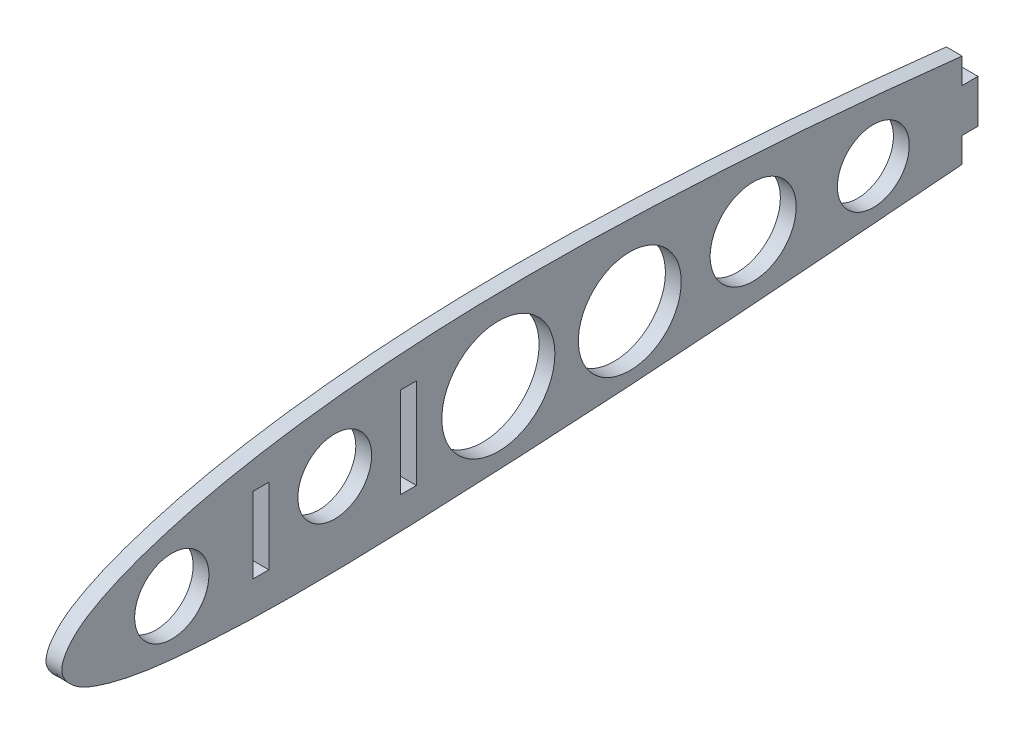
ISO-10303-21;
HEADER;
FILE_DESCRIPTION(('STEP AP214'),'2;1');
FILE_NAME('part.step','',(''),(''),'','','');
FILE_SCHEMA(('AUTOMOTIVE_DESIGN { 1 0 10303 214 1 1 1 1 }'));
ENDSEC;
DATA;
#1=APPLICATION_CONTEXT('core data for automotive mechanical design processes');
#2=APPLICATION_PROTOCOL_DEFINITION('international standard','automotive_design',2000,#1);
#3=PRODUCT_CONTEXT('',#1,'mechanical');
#4=PRODUCT('Part','Part','',(#3));
#5=PRODUCT_RELATED_PRODUCT_CATEGORY('part','',(#4));
#6=PRODUCT_DEFINITION_FORMATION('','',#4);
#7=PRODUCT_DEFINITION_CONTEXT('part definition',#1,'design');
#8=PRODUCT_DEFINITION('design','',#6,#7);
#9=PRODUCT_DEFINITION_SHAPE('','',#8);
#10=(LENGTH_UNIT() NAMED_UNIT(*) SI_UNIT(.MILLI.,.METRE.));
#11=(NAMED_UNIT(*) PLANE_ANGLE_UNIT() SI_UNIT($,.RADIAN.));
#12=(NAMED_UNIT(*) SI_UNIT($,.STERADIAN.) SOLID_ANGLE_UNIT());
#13=UNCERTAINTY_MEASURE_WITH_UNIT(LENGTH_MEASURE(1.E-05),#10,'distance_accuracy_value','');
#14=(GEOMETRIC_REPRESENTATION_CONTEXT(3) GLOBAL_UNCERTAINTY_ASSIGNED_CONTEXT((#13)) GLOBAL_UNIT_ASSIGNED_CONTEXT((#10,
#11,#12)) REPRESENTATION_CONTEXT('',''));
#15=CARTESIAN_POINT('',(0.,0.,0.));
#16=DIRECTION('',(0.,0.,1.));
#17=DIRECTION('',(1.,0.,0.));
#18=AXIS2_PLACEMENT_3D('',#15,#16,#17);
#19=CARTESIAN_POINT('',(3.,35.6725083787805,-268.796840466726));
#20=CARTESIAN_POINT('',(3.,36.4274536176114,-264.720288829096));
#21=CARTESIAN_POINT('',(3.,37.9353612910288,-256.577892295824));
#22=CARTESIAN_POINT('',(3.,40.6710911965768,-240.284487090343));
#23=CARTESIAN_POINT('',(3.,43.6582699218128,-219.915007865058));
#24=CARTESIAN_POINT('',(3.,46.6859521400267,-195.466083589585));
#25=CARTESIAN_POINT('',(3.,49.1340817664586,-171.032194679108));
#26=CARTESIAN_POINT('',(3.,50.8023986505565,-146.60254973474));
#27=CARTESIAN_POINT('',(3.,51.7826936533196,-122.191533804464));
#28=CARTESIAN_POINT('',(3.,51.6405055291905,-101.842925906633));
#29=CARTESIAN_POINT('',(3.,50.6584632078832,-85.5965779619287));
#30=CARTESIAN_POINT('',(3.,49.4402735662458,-73.4109942150779));
#31=CARTESIAN_POINT('',(3.,47.6462202215127,-61.2209387887358));
#32=CARTESIAN_POINT('',(3.,45.5296629802409,-51.0876277171563));
#33=CARTESIAN_POINT('',(3.,43.1996534506725,-43.0213639172619));
#34=CARTESIAN_POINT('',(3.,41.1045925047332,-36.9122400554517));
#35=CARTESIAN_POINT('',(3.,38.7006598345027,-31.7482460051726));
#36=CARTESIAN_POINT('',(3.,35.8207701765586,-27.3091511377608));
#37=CARTESIAN_POINT('',(3.,30.9135853099767,-23.4836316371993));
#38=CARTESIAN_POINT('',(3.,26.7429969145867,-27.6334209430324));
#39=CARTESIAN_POINT('',(3.,24.8893233487077,-32.0784001117748));
#40=CARTESIAN_POINT('',(3.,23.516154351296,-37.2912412060836));
#41=CARTESIAN_POINT('',(3.,22.5773588690756,-43.4377659033026));
#42=CARTESIAN_POINT('',(3.,21.8315270372831,-51.5949322119324));
#43=CARTESIAN_POINT('',(3.,21.3314858655082,-61.7688680642342));
#44=CARTESIAN_POINT('',(3.,21.2854162932154,-73.9746097226715));
#45=CARTESIAN_POINT('',(3.,21.5557900033601,-86.1656281806752));
#46=CARTESIAN_POINT('',(3.,22.2233845979576,-102.412296423289));
#47=CARTESIAN_POINT('',(3.,23.2550373184634,-122.718782884065));
#48=CARTESIAN_POINT('',(3.,24.8417754069201,-147.07692435792));
#49=CARTESIAN_POINT('',(3.,26.7651546502408,-171.421597620585));
#50=CARTESIAN_POINT('',(3.,28.7461770154961,-195.769310914877));
#51=CARTESIAN_POINT('',(3.,30.7458206301182,-220.120839870705));
#52=CARTESIAN_POINT('',(3.,32.5467474021077,-240.40453676189));
#53=CARTESIAN_POINT('',(3.,33.9469989708258,-256.637275317102));
#54=CARTESIAN_POINT('',(3.,34.6747704592301,-264.751495034581));
#55=CARTESIAN_POINT('',(3.,35.0386811925504,-268.808883507144));
#56=B_SPLINE_CURVE_WITH_KNOTS('',3,(#19,#20,#21,#22,#23,#24,#25,#26,#27,#28,#29,#30,#31,#32,#33,
#34,#35,#36,#37,#38,#39,#40,#41,#42,#43,#44,#45,#46,#47,#48,#49,#50,#51,#52,#53,#54,#55),
.UNSPECIFIED.,.F.,.F.,(4,1,1,1,1,1,1,1,1,1,1,1,1,1,1,1,1,1,1,1,1,1,1,1,1,1,1,1,1,1,1,1,1,1,4),
(0.,0.0250124897498648,0.0499592861642578,0.0996729249269686,0.149206319909966,
0.198581096615965,0.247805170456833,0.296916574601493,0.345952721793533,0.370491625569911,
0.395091203654929,0.41981479582396,0.444798575016595,0.457489818915221,0.47040640543549,
0.483879408669829,0.491264120322896,0.503458853294665,0.513609129403887,0.520450990700287,
0.533235387615153,0.545691039147803,0.558031884237173,0.582609167247894,0.607134741746914,
0.631652079836766,0.656174271859652,0.705233949250519,0.754320378530032,0.803437363555032,
0.852566095729537,0.901700994033254,0.95084880933727,0.975422716989278,1.),.UNSPECIFIED.);
#57=DIRECTION('',(-1.,0.,0.));
#58=VECTOR('',#57,1.);
#59=SURFACE_OF_LINEAR_EXTRUSION('',#56,#58);
#60=CARTESIAN_POINT('',(3.,46.54657380886,-195.85));
#61=VERTEX_POINT('',#60);
#62=CARTESIAN_POINT('',(3.,28.7558241716302,-195.85));
#63=VERTEX_POINT('',#62);
#64=EDGE_CURVE('E261',#61,#63,#56,.T.);
#65=ORIENTED_EDGE('',*,*,#64,.F.);
#66=DIRECTION('',(-1.,0.,0.));
#67=VECTOR('',#66,1.);
#68=CARTESIAN_POINT('',(3.,46.5465738066671,-195.85));
#69=LINE('',#68,#67);
#70=CARTESIAN_POINT('',(0.,46.54657380886,-195.85));
#71=VERTEX_POINT('',#70);
#72=EDGE_CURVE('E148',#61,#71,#69,.T.);
#73=ORIENTED_EDGE('',*,*,#72,.T.);
#74=CARTESIAN_POINT('',(0.,35.6725083787805,-268.796840466726));
#75=CARTESIAN_POINT('',(0.,36.4274536176114,-264.720288829096));
#76=CARTESIAN_POINT('',(0.,37.9353612910288,-256.577892295824));
#77=CARTESIAN_POINT('',(0.,40.6710911965768,-240.284487090343));
#78=CARTESIAN_POINT('',(0.,43.6582699218128,-219.915007865058));
#79=CARTESIAN_POINT('',(0.,46.6859521400267,-195.466083589585));
#80=CARTESIAN_POINT('',(0.,49.1340817664586,-171.032194679108));
#81=CARTESIAN_POINT('',(0.,50.8023986505565,-146.60254973474));
#82=CARTESIAN_POINT('',(0.,51.7826936533196,-122.191533804464));
#83=CARTESIAN_POINT('',(0.,51.6405055291905,-101.842925906633));
#84=CARTESIAN_POINT('',(0.,50.6584632078832,-85.5965779619287));
#85=CARTESIAN_POINT('',(0.,49.4402735662458,-73.4109942150779));
#86=CARTESIAN_POINT('',(0.,47.6462202215127,-61.2209387887358));
#87=CARTESIAN_POINT('',(0.,45.5296629802409,-51.0876277171563));
#88=CARTESIAN_POINT('',(0.,43.1996534506725,-43.0213639172619));
#89=CARTESIAN_POINT('',(0.,41.1045925047332,-36.9122400554517));
#90=CARTESIAN_POINT('',(0.,38.7006598345027,-31.7482460051726));
#91=CARTESIAN_POINT('',(0.,35.8207701765586,-27.3091511377608));
#92=CARTESIAN_POINT('',(0.,30.9135853099767,-23.4836316371993));
#93=CARTESIAN_POINT('',(0.,26.7429969145867,-27.6334209430324));
#94=CARTESIAN_POINT('',(0.,24.8893233487077,-32.0784001117748));
#95=CARTESIAN_POINT('',(0.,23.516154351296,-37.2912412060836));
#96=CARTESIAN_POINT('',(0.,22.5773588690756,-43.4377659033026));
#97=CARTESIAN_POINT('',(0.,21.8315270372831,-51.5949322119324));
#98=CARTESIAN_POINT('',(0.,21.3314858655082,-61.7688680642342));
#99=CARTESIAN_POINT('',(0.,21.2854162932154,-73.9746097226715));
#100=CARTESIAN_POINT('',(0.,21.5557900033601,-86.1656281806752));
#101=CARTESIAN_POINT('',(0.,22.2233845979576,-102.412296423289));
#102=CARTESIAN_POINT('',(0.,23.2550373184634,-122.718782884065));
#103=CARTESIAN_POINT('',(0.,24.8417754069201,-147.07692435792));
#104=CARTESIAN_POINT('',(0.,26.7651546502408,-171.421597620585));
#105=CARTESIAN_POINT('',(0.,28.7461770154961,-195.769310914877));
#106=CARTESIAN_POINT('',(0.,30.7458206301182,-220.120839870705));
#107=CARTESIAN_POINT('',(0.,32.5467474021077,-240.40453676189));
#108=CARTESIAN_POINT('',(0.,33.9469989708258,-256.637275317102));
#109=CARTESIAN_POINT('',(0.,34.6747704592301,-264.751495034581));
#110=CARTESIAN_POINT('',(0.,35.0386811925504,-268.808883507144));
#111=B_SPLINE_CURVE_WITH_KNOTS('',3,(#74,#75,#76,#77,#78,#79,#80,#81,#82,#83,#84,#85,#86,#87,
#88,#89,#90,#91,#92,#93,#94,#95,#96,#97,#98,#99,#100,#101,#102,#103,#104,#105,#106,#107,#108,
#109,#110),.UNSPECIFIED.,.F.,.F.,(4,1,1,1,1,1,1,1,1,1,1,1,1,1,1,1,1,1,1,1,1,1,1,1,1,1,1,1,1,1,1,
1,1,1,4),(0.,0.0250124897498648,0.0499592861642578,0.0996729249269686,0.149206319909966,
0.198581096615965,0.247805170456833,0.296916574601493,0.345952721793533,0.370491625569911,
0.395091203654929,0.41981479582396,0.444798575016595,0.457489818915221,0.47040640543549,
0.483879408669829,0.491264120322896,0.503458853294665,0.513609129403887,0.520450990700287,
0.533235387615153,0.545691039147803,0.558031884237173,0.582609167247894,0.607134741746914,
0.631652079836766,0.656174271859652,0.705233949250519,0.754320378530032,0.803437363555032,
0.852566095729537,0.901700994033254,0.95084880933727,0.975422716989278,1.),.UNSPECIFIED.);
#112=CARTESIAN_POINT('',(0.,28.7558241716302,-195.85));
#113=VERTEX_POINT('',#112);
#114=EDGE_CURVE('E260',#71,#113,#111,.T.);
#115=ORIENTED_EDGE('',*,*,#114,.T.);
#116=DIRECTION('',(-1.,0.,0.));
#117=VECTOR('',#116,1.);
#118=CARTESIAN_POINT('',(3.,28.7558241716302,-195.85));
#119=LINE('',#118,#117);
#120=EDGE_CURVE('E169',#113,#63,#119,.F.);
#121=ORIENTED_EDGE('',*,*,#120,.T.);
#122=EDGE_LOOP('',(#65,#73,#115,#121));
#123=FACE_BOUND('',#122,.T.);
#124=ADVANCED_FACE('F37',(#123),#59,.F.);
#125=CARTESIAN_POINT('',(3.,32.3296105524664,-25.2194378154386));
#126=DIRECTION('',(-1.,0.,0.));
#127=DIRECTION('',(0.,0.,1.));
#128=AXIS2_PLACEMENT_3D('',#125,#126,#127);
#129=PLANE('',#128);
#130=CARTESIAN_POINT('',(3.,32.7699956638871,-45.8730282964202));
#131=DIRECTION('',(1.,0.,0.));
#132=DIRECTION('',(0.,0.,-1.));
#133=AXIS2_PLACEMENT_3D('',#130,#131,#132);
#134=CIRCLE('',#133,7.04485787294361);
#135=CARTESIAN_POINT('',(3.,32.7699956638871,-52.9178861693638));
#136=VERTEX_POINT('',#135);
#137=EDGE_CURVE('E174',#136,#136,#134,.T.);
#138=ORIENTED_EDGE('',*,*,#137,.F.);
#139=EDGE_LOOP('',(#138));
#140=FACE_BOUND('',#139,.T.);
#141=CARTESIAN_POINT('',(3.,36.2890999852374,-107.839865259326));
#142=DIRECTION('',(1.,0.,0.));
#143=DIRECTION('',(0.,0.,-1.));
#144=AXIS2_PLACEMENT_3D('',#141,#142,#143);
#145=CIRCLE('',#144,10.7245156528873);
#146=CARTESIAN_POINT('',(3.,36.2890999852374,-118.564380912214));
#147=VERTEX_POINT('',#146);
#148=EDGE_CURVE('E178',#147,#147,#145,.T.);
#149=ORIENTED_EDGE('',*,*,#148,.F.);
#150=EDGE_LOOP('',(#149));
#151=FACE_BOUND('',#150,.T.);
#152=CARTESIAN_POINT('',(3.,36.1360954495265,-132.7796045802));
#153=DIRECTION('',(1.,0.,0.));
#154=DIRECTION('',(0.,0.,-1.));
#155=AXIS2_PLACEMENT_3D('',#152,#153,#154);
#156=CIRCLE('',#155,9.75876314769846);
#157=CARTESIAN_POINT('',(3.,36.1360954495265,-142.538367727898));
#158=VERTEX_POINT('',#157);
#159=EDGE_CURVE('E181',#158,#158,#156,.T.);
#160=ORIENTED_EDGE('',*,*,#159,.F.);
#161=EDGE_LOOP('',(#160));
#162=FACE_BOUND('',#161,.T.);
#163=CARTESIAN_POINT('',(3.,37.5131362709244,-156.189298543964));
#164=DIRECTION('',(1.,0.,0.));
#165=DIRECTION('',(0.,0.,-1.));
#166=AXIS2_PLACEMENT_3D('',#163,#164,#165);
#167=CIRCLE('',#166,8.16103876429646);
#168=CARTESIAN_POINT('',(3.,37.5131362709244,-164.350337308261));
#169=VERTEX_POINT('',#168);
#170=EDGE_CURVE('E184',#169,#169,#167,.T.);
#171=ORIENTED_EDGE('',*,*,#170,.F.);
#172=EDGE_LOOP('',(#171));
#173=FACE_BOUND('',#172,.T.);
#174=CARTESIAN_POINT('',(3.,36.9011181280809,-178.986974364885));
#175=DIRECTION('',(1.,0.,0.));
#176=DIRECTION('',(0.,0.,-1.));
#177=AXIS2_PLACEMENT_3D('',#174,#175,#176);
#178=CIRCLE('',#177,6.81686292050693);
#179=CARTESIAN_POINT('',(3.,36.9011181280809,-185.803837285392));
#180=VERTEX_POINT('',#179);
#181=EDGE_CURVE('E173',#180,#180,#178,.T.);
#182=ORIENTED_EDGE('',*,*,#181,.F.);
#183=EDGE_LOOP('',(#182));
#184=FACE_BOUND('',#183,.T.);
#185=DIRECTION('',(0.,0.,-1.));
#186=VECTOR('',#185,1.);
#187=CARTESIAN_POINT('',(3.,27.7557051291616,-89.2899999999998));
#188=LINE('',#187,#186);
#189=CARTESIAN_POINT('',(3.,27.7557051291616,-89.2899999999999));
#190=VERTEX_POINT('',#189);
#191=CARTESIAN_POINT('',(3.,27.7557051291616,-92.2899999999999));
#192=VERTEX_POINT('',#191);
#193=EDGE_CURVE('E241',#190,#192,#188,.T.);
#194=ORIENTED_EDGE('',*,*,#193,.F.);
#195=DIRECTION('',(0.,-1.,0.));
#196=VECTOR('',#195,1.);
#197=CARTESIAN_POINT('',(3.,44.9516434055938,-89.2899999999998));
#198=LINE('',#197,#196);
#199=CARTESIAN_POINT('',(3.,44.9516434055938,-89.2899999999998));
#200=VERTEX_POINT('',#199);
#201=EDGE_CURVE('E199',#200,#190,#198,.T.);
#202=ORIENTED_EDGE('',*,*,#201,.F.);
#203=DIRECTION('',(0.,0.,1.));
#204=VECTOR('',#203,1.);
#205=CARTESIAN_POINT('',(3.,44.9516434055938,-89.2899999999998));
#206=LINE('',#205,#204);
#207=CARTESIAN_POINT('',(3.,44.9516434055938,-92.2899999999999));
#208=VERTEX_POINT('',#207);
#209=EDGE_CURVE('E234',#208,#200,#206,.T.);
#210=ORIENTED_EDGE('',*,*,#209,.F.);
#211=DIRECTION('',(0.,1.,0.));
#212=VECTOR('',#211,1.);
#213=CARTESIAN_POINT('',(3.,44.9516434055938,-92.2899999999999));
#214=LINE('',#213,#212);
#215=EDGE_CURVE('E237',#192,#208,#214,.T.);
#216=ORIENTED_EDGE('',*,*,#215,.F.);
#217=EDGE_LOOP('',(#194,#202,#210,#216));
#218=FACE_BOUND('',#217,.T.);
#219=DIRECTION('',(0.,0.,-1.));
#220=VECTOR('',#219,1.);
#221=CARTESIAN_POINT('',(3.,27.8986668462479,-61.2899999999999));
#222=LINE('',#221,#220);
#223=CARTESIAN_POINT('',(3.,27.8986668462479,-61.2899999999999));
#224=VERTEX_POINT('',#223);
#225=CARTESIAN_POINT('',(3.,27.8986668462479,-64.2899999999999));
#226=VERTEX_POINT('',#225);
#227=EDGE_CURVE('E207',#224,#226,#222,.T.);
#228=ORIENTED_EDGE('',*,*,#227,.F.);
#229=DIRECTION('',(0.,-1.,0.));
#230=VECTOR('',#229,1.);
#231=CARTESIAN_POINT('',(3.,42.2942252589825,-61.2899999999999));
#232=LINE('',#231,#230);
#233=CARTESIAN_POINT('',(3.,42.2942252589825,-61.2899999999999));
#234=VERTEX_POINT('',#233);
#235=EDGE_CURVE('E210',#234,#224,#232,.T.);
#236=ORIENTED_EDGE('',*,*,#235,.F.);
#237=DIRECTION('',(0.,0.,1.));
#238=VECTOR('',#237,1.);
#239=CARTESIAN_POINT('',(3.,42.2942252589825,-61.2899999999999));
#240=LINE('',#239,#238);
#241=CARTESIAN_POINT('',(3.,42.2942252589825,-64.2899999999999));
#242=VERTEX_POINT('',#241);
#243=EDGE_CURVE('E200',#242,#234,#240,.T.);
#244=ORIENTED_EDGE('',*,*,#243,.F.);
#245=DIRECTION('',(0.,1.,0.));
#246=VECTOR('',#245,1.);
#247=CARTESIAN_POINT('',(3.,42.2942252589825,-64.2899999999999));
#248=LINE('',#247,#246);
#249=EDGE_CURVE('E203',#226,#242,#248,.T.);
#250=ORIENTED_EDGE('',*,*,#249,.F.);
#251=EDGE_LOOP('',(#228,#236,#244,#250));
#252=FACE_BOUND('',#251,.T.);
#253=CARTESIAN_POINT('',(3.,36.9902555428248,-76.7899999999998));
#254=DIRECTION('',(1.,0.,0.));
#255=DIRECTION('',(0.,0.,-1.));
#256=AXIS2_PLACEMENT_3D('',#253,#254,#255);
#257=CIRCLE('',#256,7.);
#258=CARTESIAN_POINT('',(3.,36.9902555428248,-83.7899999999998));
#259=VERTEX_POINT('',#258);
#260=EDGE_CURVE('E212',#259,#259,#257,.T.);
#261=ORIENTED_EDGE('',*,*,#260,.F.);
#262=EDGE_LOOP('',(#261));
#263=FACE_BOUND('',#262,.T.);
#264=DIRECTION('',(0.,-1.,0.));
#265=VECTOR('',#264,1.);
#266=CARTESIAN_POINT('',(3.,69.3791113259727,-198.85));
#267=LINE('',#266,#265);
#268=CARTESIAN_POINT('',(3.,41.7050659841766,-198.85));
#269=VERTEX_POINT('',#268);
#270=CARTESIAN_POINT('',(3.,33.501238576268,-198.85));
#271=VERTEX_POINT('',#270);
#272=EDGE_CURVE('E158',#269,#271,#267,.T.);
#273=ORIENTED_EDGE('',*,*,#272,.F.);
#274=DIRECTION('',(0.,0.,-1.));
#275=VECTOR('',#274,1.);
#276=CARTESIAN_POINT('',(3.,41.7050659841766,-198.85));
#277=LINE('',#276,#275);
#278=CARTESIAN_POINT('',(3.,41.7050659841766,-195.85));
#279=VERTEX_POINT('',#278);
#280=EDGE_CURVE('E60',#279,#269,#277,.T.);
#281=ORIENTED_EDGE('',*,*,#280,.F.);
#282=DIRECTION('',(0.,-1.,0.));
#283=VECTOR('',#282,1.);
#284=CARTESIAN_POINT('',(3.,41.7050659841766,-195.85));
#285=LINE('',#284,#283);
#286=EDGE_CURVE('E145',#61,#279,#285,.T.);
#287=ORIENTED_EDGE('',*,*,#286,.F.);
#288=ORIENTED_EDGE('',*,*,#64,.T.);
#289=DIRECTION('',(0.,-1.,0.));
#290=VECTOR('',#289,1.);
#291=CARTESIAN_POINT('',(3.,33.501238576268,-195.85));
#292=LINE('',#291,#290);
#293=CARTESIAN_POINT('',(3.,33.501238576268,-195.85));
#294=VERTEX_POINT('',#293);
#295=EDGE_CURVE('E163',#294,#63,#292,.T.);
#296=ORIENTED_EDGE('',*,*,#295,.F.);
#297=DIRECTION('',(0.,0.,1.));
#298=VECTOR('',#297,1.);
#299=CARTESIAN_POINT('',(3.,33.501238576268,-198.85));
#300=LINE('',#299,#298);
#301=EDGE_CURVE('E152',#271,#294,#300,.T.);
#302=ORIENTED_EDGE('',*,*,#301,.F.);
#303=EDGE_LOOP('',(#273,#281,#287,#288,#296,#302));
#304=FACE_BOUND('',#303,.T.);
#305=ADVANCED_FACE('F155',(#140,#151,#162,#173,#184,#218,#252,#263,#304),#129,.F.);
#306=CARTESIAN_POINT('',(0.,32.3296105524664,-25.2194378154386));
#307=DIRECTION('',(-1.,0.,0.));
#308=DIRECTION('',(0.,0.,1.));
#309=AXIS2_PLACEMENT_3D('',#306,#307,#308);
#310=PLANE('',#309);
#311=DIRECTION('',(0.,0.,1.));
#312=VECTOR('',#311,1.);
#313=CARTESIAN_POINT('',(0.,41.7050659841762,-25.2194378154386));
#314=LINE('',#313,#312);
#315=CARTESIAN_POINT('',(0.,41.7050659841766,-198.85));
#316=VERTEX_POINT('',#315);
#317=CARTESIAN_POINT('',(0.,41.7050659841766,-195.85));
#318=VERTEX_POINT('',#317);
#319=EDGE_CURVE('E140',#316,#318,#314,.T.);
#320=ORIENTED_EDGE('',*,*,#319,.F.);
#321=DIRECTION('',(0.,1.,0.));
#322=VECTOR('',#321,1.);
#323=CARTESIAN_POINT('',(0.,32.3296105524665,-198.85));
#324=LINE('',#323,#322);
#325=CARTESIAN_POINT('',(0.,33.501238576268,-198.85));
#326=VERTEX_POINT('',#325);
#327=EDGE_CURVE('E266',#326,#316,#324,.T.);
#328=ORIENTED_EDGE('',*,*,#327,.F.);
#329=DIRECTION('',(0.,0.,-1.));
#330=VECTOR('',#329,1.);
#331=CARTESIAN_POINT('',(0.,33.501238576268,-25.2194378154386));
#332=LINE('',#331,#330);
#333=CARTESIAN_POINT('',(0.,33.501238576268,-195.85));
#334=VERTEX_POINT('',#333);
#335=EDGE_CURVE('E52',#334,#326,#332,.T.);
#336=ORIENTED_EDGE('',*,*,#335,.F.);
#337=DIRECTION('',(0.,1.,0.));
#338=VECTOR('',#337,1.);
#339=CARTESIAN_POINT('',(0.,32.3296105524664,-195.85));
#340=LINE('',#339,#338);
#341=EDGE_CURVE('E45',#113,#334,#340,.T.);
#342=ORIENTED_EDGE('',*,*,#341,.F.);
#343=ORIENTED_EDGE('',*,*,#114,.F.);
#344=DIRECTION('',(0.,1.,0.));
#345=VECTOR('',#344,1.);
#346=CARTESIAN_POINT('',(0.,32.3296105524664,-195.85));
#347=LINE('',#346,#345);
#348=EDGE_CURVE('E11',#318,#71,#347,.T.);
#349=ORIENTED_EDGE('',*,*,#348,.F.);
#350=EDGE_LOOP('',(#320,#328,#336,#342,#343,#349));
#351=FACE_BOUND('',#350,.T.);
#352=CARTESIAN_POINT('',(0.,32.7699956638871,-45.8730282964202));
#353=DIRECTION('',(-1.,0.,0.));
#354=DIRECTION('',(0.,0.,1.));
#355=AXIS2_PLACEMENT_3D('',#352,#353,#354);
#356=CIRCLE('',#355,7.04485787294361);
#357=CARTESIAN_POINT('',(0.,32.7699956638871,-38.8281704234766));
#358=VERTEX_POINT('',#357);
#359=EDGE_CURVE('E233',#358,#358,#356,.T.);
#360=ORIENTED_EDGE('',*,*,#359,.F.);
#361=EDGE_LOOP('',(#360));
#362=FACE_BOUND('',#361,.T.);
#363=CARTESIAN_POINT('',(0.,36.2890999852374,-107.839865259326));
#364=DIRECTION('',(-1.,0.,0.));
#365=DIRECTION('',(0.,0.,1.));
#366=AXIS2_PLACEMENT_3D('',#363,#364,#365);
#367=CIRCLE('',#366,10.7245156528873);
#368=CARTESIAN_POINT('',(0.,36.2890999852374,-97.115349606439));
#369=VERTEX_POINT('',#368);
#370=EDGE_CURVE('E288',#369,#369,#367,.T.);
#371=ORIENTED_EDGE('',*,*,#370,.F.);
#372=EDGE_LOOP('',(#371));
#373=FACE_BOUND('',#372,.T.);
#374=CARTESIAN_POINT('',(0.,36.1360954495265,-132.7796045802));
#375=DIRECTION('',(-1.,0.,0.));
#376=DIRECTION('',(0.,0.,1.));
#377=AXIS2_PLACEMENT_3D('',#374,#375,#376);
#378=CIRCLE('',#377,9.75876314769846);
#379=CARTESIAN_POINT('',(0.,36.1360954495265,-123.020841432501));
#380=VERTEX_POINT('',#379);
#381=EDGE_CURVE('E285',#380,#380,#378,.T.);
#382=ORIENTED_EDGE('',*,*,#381,.F.);
#383=EDGE_LOOP('',(#382));
#384=FACE_BOUND('',#383,.T.);
#385=CARTESIAN_POINT('',(0.,37.5131362709244,-156.189298543964));
#386=DIRECTION('',(-1.,0.,0.));
#387=DIRECTION('',(0.,0.,1.));
#388=AXIS2_PLACEMENT_3D('',#385,#386,#387);
#389=CIRCLE('',#388,8.16103876429646);
#390=CARTESIAN_POINT('',(0.,37.5131362709244,-148.028259779668));
#391=VERTEX_POINT('',#390);
#392=EDGE_CURVE('E282',#391,#391,#389,.T.);
#393=ORIENTED_EDGE('',*,*,#392,.F.);
#394=EDGE_LOOP('',(#393));
#395=FACE_BOUND('',#394,.T.);
#396=CARTESIAN_POINT('',(0.,36.9011181280809,-178.986974364885));
#397=DIRECTION('',(-1.,0.,0.));
#398=DIRECTION('',(0.,0.,1.));
#399=AXIS2_PLACEMENT_3D('',#396,#397,#398);
#400=CIRCLE('',#399,6.81686292050693);
#401=CARTESIAN_POINT('',(0.,36.9011181280809,-172.170111444378));
#402=VERTEX_POINT('',#401);
#403=EDGE_CURVE('E177',#402,#402,#400,.T.);
#404=ORIENTED_EDGE('',*,*,#403,.F.);
#405=EDGE_LOOP('',(#404));
#406=FACE_BOUND('',#405,.T.);
#407=DIRECTION('',(0.,-1.,0.));
#408=VECTOR('',#407,1.);
#409=CARTESIAN_POINT('',(0.,44.9516434055938,-89.2899999999998));
#410=LINE('',#409,#408);
#411=CARTESIAN_POINT('',(0.,44.9516434055938,-89.2899999999998));
#412=VERTEX_POINT('',#411);
#413=CARTESIAN_POINT('',(0.,27.7557051291616,-89.2899999999998));
#414=VERTEX_POINT('',#413);
#415=EDGE_CURVE('E238',#412,#414,#410,.T.);
#416=ORIENTED_EDGE('',*,*,#415,.T.);
#417=DIRECTION('',(0.,0.,-1.));
#418=VECTOR('',#417,1.);
#419=CARTESIAN_POINT('',(0.,27.7557051291616,-89.2899999999998));
#420=LINE('',#419,#418);
#421=CARTESIAN_POINT('',(0.,27.7557051291616,-92.2899999999999));
#422=VERTEX_POINT('',#421);
#423=EDGE_CURVE('E250',#414,#422,#420,.T.);
#424=ORIENTED_EDGE('',*,*,#423,.T.);
#425=DIRECTION('',(0.,1.,0.));
#426=VECTOR('',#425,1.);
#427=CARTESIAN_POINT('',(0.,44.9516434055938,-92.2899999999999));
#428=LINE('',#427,#426);
#429=CARTESIAN_POINT('',(0.,44.9516434055938,-92.2899999999999));
#430=VERTEX_POINT('',#429);
#431=EDGE_CURVE('E247',#422,#430,#428,.T.);
#432=ORIENTED_EDGE('',*,*,#431,.T.);
#433=DIRECTION('',(0.,0.,1.));
#434=VECTOR('',#433,1.);
#435=CARTESIAN_POINT('',(0.,44.9516434055938,-89.2899999999998));
#436=LINE('',#435,#434);
#437=EDGE_CURVE('E226',#430,#412,#436,.T.);
#438=ORIENTED_EDGE('',*,*,#437,.T.);
#439=EDGE_LOOP('',(#416,#424,#432,#438));
#440=FACE_BOUND('',#439,.T.);
#441=DIRECTION('',(0.,-1.,0.));
#442=VECTOR('',#441,1.);
#443=CARTESIAN_POINT('',(0.,42.2942252589825,-61.2899999999999));
#444=LINE('',#443,#442);
#445=CARTESIAN_POINT('',(0.,42.2942252589825,-61.2899999999999));
#446=VERTEX_POINT('',#445);
#447=CARTESIAN_POINT('',(0.,27.8986668462479,-61.2899999999999));
#448=VERTEX_POINT('',#447);
#449=EDGE_CURVE('E204',#446,#448,#444,.T.);
#450=ORIENTED_EDGE('',*,*,#449,.T.);
#451=DIRECTION('',(0.,0.,-1.));
#452=VECTOR('',#451,1.);
#453=CARTESIAN_POINT('',(0.,27.8986668462479,-61.2899999999999));
#454=LINE('',#453,#452);
#455=CARTESIAN_POINT('',(0.,27.8986668462479,-64.2899999999999));
#456=VERTEX_POINT('',#455);
#457=EDGE_CURVE('E218',#448,#456,#454,.T.);
#458=ORIENTED_EDGE('',*,*,#457,.T.);
#459=DIRECTION('',(0.,1.,0.));
#460=VECTOR('',#459,1.);
#461=CARTESIAN_POINT('',(0.,42.2942252589825,-64.2899999999999));
#462=LINE('',#461,#460);
#463=CARTESIAN_POINT('',(0.,42.2942252589825,-64.2899999999999));
#464=VERTEX_POINT('',#463);
#465=EDGE_CURVE('E215',#456,#464,#462,.T.);
#466=ORIENTED_EDGE('',*,*,#465,.T.);
#467=DIRECTION('',(0.,0.,1.));
#468=VECTOR('',#467,1.);
#469=CARTESIAN_POINT('',(0.,42.2942252589825,-61.2899999999999));
#470=LINE('',#469,#468);
#471=EDGE_CURVE('E192',#464,#446,#470,.T.);
#472=ORIENTED_EDGE('',*,*,#471,.T.);
#473=EDGE_LOOP('',(#450,#458,#466,#472));
#474=FACE_BOUND('',#473,.T.);
#475=CARTESIAN_POINT('',(0.,36.9902555428248,-76.7899999999998));
#476=DIRECTION('',(1.,0.,0.));
#477=DIRECTION('',(0.,0.,-1.));
#478=AXIS2_PLACEMENT_3D('',#475,#476,#477);
#479=CIRCLE('',#478,7.);
#480=CARTESIAN_POINT('',(0.,36.9902555428248,-83.7899999999998));
#481=VERTEX_POINT('',#480);
#482=EDGE_CURVE('E255',#481,#481,#479,.T.);
#483=ORIENTED_EDGE('',*,*,#482,.T.);
#484=EDGE_LOOP('',(#483));
#485=FACE_BOUND('',#484,.T.);
#486=ADVANCED_FACE('F303',(#351,#362,#373,#384,#395,#406,#440,#474,#485),#310,.T.);
#487=CARTESIAN_POINT('',(0.,69.3791113259727,-198.85));
#488=DIRECTION('',(0.,0.,1.));
#489=DIRECTION('',(0.,-1.,0.));
#490=AXIS2_PLACEMENT_3D('',#487,#488,#489);
#491=PLANE('',#490);
#492=ORIENTED_EDGE('',*,*,#327,.T.);
#493=DIRECTION('',(1.,0.,0.));
#494=VECTOR('',#493,1.);
#495=CARTESIAN_POINT('',(0.,41.7050659841766,-198.85));
#496=LINE('',#495,#494);
#497=EDGE_CURVE('E294',#316,#269,#496,.T.);
#498=ORIENTED_EDGE('',*,*,#497,.T.);
#499=ORIENTED_EDGE('',*,*,#272,.T.);
#500=DIRECTION('',(-1.,0.,0.));
#501=VECTOR('',#500,1.);
#502=CARTESIAN_POINT('',(0.,33.501238576268,-198.85));
#503=LINE('',#502,#501);
#504=EDGE_CURVE('E279',#271,#326,#503,.T.);
#505=ORIENTED_EDGE('',*,*,#504,.T.);
#506=EDGE_LOOP('',(#492,#498,#499,#505));
#507=FACE_BOUND('',#506,.T.);
#508=ADVANCED_FACE('F306',(#507),#491,.F.);
#509=CARTESIAN_POINT('',(0.,36.9902555428248,-76.7899999999998));
#510=DIRECTION('',(1.,0.,0.));
#511=DIRECTION('',(0.,0.,-1.));
#512=AXIS2_PLACEMENT_3D('',#509,#510,#511);
#513=CYLINDRICAL_SURFACE('',#512,7.);
#514=ORIENTED_EDGE('',*,*,#482,.F.);
#515=EDGE_LOOP('',(#514));
#516=FACE_BOUND('',#515,.T.);
#517=ORIENTED_EDGE('',*,*,#260,.T.);
#518=EDGE_LOOP('',(#517));
#519=FACE_BOUND('',#518,.T.);
#520=ADVANCED_FACE('F322',(#516,#519),#513,.F.);
#521=CARTESIAN_POINT('',(0.,42.2942252589825,-61.2899999999999));
#522=DIRECTION('',(0.,0.,1.));
#523=DIRECTION('',(0.,-1.,0.));
#524=AXIS2_PLACEMENT_3D('',#521,#522,#523);
#525=PLANE('',#524);
#526=ORIENTED_EDGE('',*,*,#235,.T.);
#527=DIRECTION('',(1.,0.,0.));
#528=VECTOR('',#527,1.);
#529=CARTESIAN_POINT('',(0.,27.8986668462479,-61.2899999999999));
#530=LINE('',#529,#528);
#531=EDGE_CURVE('E189',#448,#224,#530,.T.);
#532=ORIENTED_EDGE('',*,*,#531,.F.);
#533=ORIENTED_EDGE('',*,*,#449,.F.);
#534=DIRECTION('',(1.,0.,0.));
#535=VECTOR('',#534,1.);
#536=CARTESIAN_POINT('',(0.,42.2942252589825,-61.2899999999999));
#537=LINE('',#536,#535);
#538=EDGE_CURVE('E197',#446,#234,#537,.T.);
#539=ORIENTED_EDGE('',*,*,#538,.T.);
#540=EDGE_LOOP('',(#526,#532,#533,#539));
#541=FACE_BOUND('',#540,.T.);
#542=ADVANCED_FACE('F325',(#541),#525,.F.);
#543=CARTESIAN_POINT('',(0.,42.2942252589825,-61.2899999999999));
#544=DIRECTION('',(0.,1.,0.));
#545=DIRECTION('',(0.,0.,1.));
#546=AXIS2_PLACEMENT_3D('',#543,#544,#545);
#547=PLANE('',#546);
#548=ORIENTED_EDGE('',*,*,#243,.T.);
#549=ORIENTED_EDGE('',*,*,#538,.F.);
#550=ORIENTED_EDGE('',*,*,#471,.F.);
#551=DIRECTION('',(1.,0.,0.));
#552=VECTOR('',#551,1.);
#553=CARTESIAN_POINT('',(0.,42.2942252589825,-64.2899999999999));
#554=LINE('',#553,#552);
#555=EDGE_CURVE('E195',#464,#242,#554,.T.);
#556=ORIENTED_EDGE('',*,*,#555,.T.);
#557=EDGE_LOOP('',(#548,#549,#550,#556));
#558=FACE_BOUND('',#557,.T.);
#559=ADVANCED_FACE('F345',(#558),#547,.F.);
#560=CARTESIAN_POINT('',(0.,42.2942252589825,-64.2899999999999));
#561=DIRECTION('',(0.,0.,-1.));
#562=DIRECTION('',(-1.,0.,0.));
#563=AXIS2_PLACEMENT_3D('',#560,#561,#562);
#564=PLANE('',#563);
#565=ORIENTED_EDGE('',*,*,#249,.T.);
#566=ORIENTED_EDGE('',*,*,#555,.F.);
#567=ORIENTED_EDGE('',*,*,#465,.F.);
#568=DIRECTION('',(1.,0.,0.));
#569=VECTOR('',#568,1.);
#570=CARTESIAN_POINT('',(0.,27.8986668462479,-64.2899999999999));
#571=LINE('',#570,#569);
#572=EDGE_CURVE('E193',#456,#226,#571,.T.);
#573=ORIENTED_EDGE('',*,*,#572,.T.);
#574=EDGE_LOOP('',(#565,#566,#567,#573));
#575=FACE_BOUND('',#574,.T.);
#576=ADVANCED_FACE('F348',(#575),#564,.F.);
#577=CARTESIAN_POINT('',(0.,27.8986668462479,-61.2899999999999));
#578=DIRECTION('',(0.,-1.,0.));
#579=DIRECTION('',(0.,0.,-1.));
#580=AXIS2_PLACEMENT_3D('',#577,#578,#579);
#581=PLANE('',#580);
#582=ORIENTED_EDGE('',*,*,#227,.T.);
#583=ORIENTED_EDGE('',*,*,#572,.F.);
#584=ORIENTED_EDGE('',*,*,#457,.F.);
#585=ORIENTED_EDGE('',*,*,#531,.T.);
#586=EDGE_LOOP('',(#582,#583,#584,#585));
#587=FACE_BOUND('',#586,.T.);
#588=ADVANCED_FACE('F343',(#587),#581,.F.);
#589=CARTESIAN_POINT('',(0.,44.9516434055938,-89.2899999999998));
#590=DIRECTION('',(0.,0.,1.));
#591=DIRECTION('',(1.,0.,0.));
#592=AXIS2_PLACEMENT_3D('',#589,#590,#591);
#593=PLANE('',#592);
#594=ORIENTED_EDGE('',*,*,#201,.T.);
#595=DIRECTION('',(1.,0.,0.));
#596=VECTOR('',#595,1.);
#597=CARTESIAN_POINT('',(0.,27.7557051291616,-89.2899999999998));
#598=LINE('',#597,#596);
#599=EDGE_CURVE('E223',#414,#190,#598,.T.);
#600=ORIENTED_EDGE('',*,*,#599,.F.);
#601=ORIENTED_EDGE('',*,*,#415,.F.);
#602=DIRECTION('',(1.,0.,0.));
#603=VECTOR('',#602,1.);
#604=CARTESIAN_POINT('',(0.,44.9516434055938,-89.2899999999998));
#605=LINE('',#604,#603);
#606=EDGE_CURVE('E231',#412,#200,#605,.T.);
#607=ORIENTED_EDGE('',*,*,#606,.T.);
#608=EDGE_LOOP('',(#594,#600,#601,#607));
#609=FACE_BOUND('',#608,.T.);
#610=ADVANCED_FACE('F331',(#609),#593,.F.);
#611=CARTESIAN_POINT('',(0.,44.9516434055938,-89.2899999999998));
#612=DIRECTION('',(0.,1.,0.));
#613=DIRECTION('',(0.,0.,1.));
#614=AXIS2_PLACEMENT_3D('',#611,#612,#613);
#615=PLANE('',#614);
#616=ORIENTED_EDGE('',*,*,#209,.T.);
#617=ORIENTED_EDGE('',*,*,#606,.F.);
#618=ORIENTED_EDGE('',*,*,#437,.F.);
#619=DIRECTION('',(1.,0.,0.));
#620=VECTOR('',#619,1.);
#621=CARTESIAN_POINT('',(0.,44.9516434055938,-92.2899999999999));
#622=LINE('',#621,#620);
#623=EDGE_CURVE('E229',#430,#208,#622,.T.);
#624=ORIENTED_EDGE('',*,*,#623,.T.);
#625=EDGE_LOOP('',(#616,#617,#618,#624));
#626=FACE_BOUND('',#625,.T.);
#627=ADVANCED_FACE('F327',(#626),#615,.F.);
#628=CARTESIAN_POINT('',(0.,44.9516434055938,-92.2899999999999));
#629=DIRECTION('',(0.,0.,-1.));
#630=DIRECTION('',(-1.,0.,0.));
#631=AXIS2_PLACEMENT_3D('',#628,#629,#630);
#632=PLANE('',#631);
#633=ORIENTED_EDGE('',*,*,#215,.T.);
#634=ORIENTED_EDGE('',*,*,#623,.F.);
#635=ORIENTED_EDGE('',*,*,#431,.F.);
#636=DIRECTION('',(1.,0.,0.));
#637=VECTOR('',#636,1.);
#638=CARTESIAN_POINT('',(0.,27.7557051291616,-92.2899999999999));
#639=LINE('',#638,#637);
#640=EDGE_CURVE('E227',#422,#192,#639,.T.);
#641=ORIENTED_EDGE('',*,*,#640,.T.);
#642=EDGE_LOOP('',(#633,#634,#635,#641));
#643=FACE_BOUND('',#642,.T.);
#644=ADVANCED_FACE('F330',(#643),#632,.F.);
#645=CARTESIAN_POINT('',(0.,27.7557051291616,-89.2899999999998));
#646=DIRECTION('',(0.,-1.,0.));
#647=DIRECTION('',(0.,0.,-1.));
#648=AXIS2_PLACEMENT_3D('',#645,#646,#647);
#649=PLANE('',#648);
#650=ORIENTED_EDGE('',*,*,#193,.T.);
#651=ORIENTED_EDGE('',*,*,#640,.F.);
#652=ORIENTED_EDGE('',*,*,#423,.F.);
#653=ORIENTED_EDGE('',*,*,#599,.T.);
#654=EDGE_LOOP('',(#650,#651,#652,#653));
#655=FACE_BOUND('',#654,.T.);
#656=ADVANCED_FACE('F335',(#655),#649,.F.);
#657=CARTESIAN_POINT('',(-7.,36.9011181280809,-178.986974364885));
#658=DIRECTION('',(1.,0.,0.));
#659=DIRECTION('',(0.,0.,-1.));
#660=AXIS2_PLACEMENT_3D('',#657,#658,#659);
#661=CYLINDRICAL_SURFACE('',#660,6.81686292050693);
#662=ORIENTED_EDGE('',*,*,#403,.T.);
#663=EDGE_LOOP('',(#662));
#664=FACE_BOUND('',#663,.T.);
#665=ORIENTED_EDGE('',*,*,#181,.T.);
#666=EDGE_LOOP('',(#665));
#667=FACE_BOUND('',#666,.T.);
#668=ADVANCED_FACE('F339',(#664,#667),#661,.F.);
#669=CARTESIAN_POINT('',(-7.,37.5131362709244,-156.189298543964));
#670=DIRECTION('',(1.,0.,0.));
#671=DIRECTION('',(0.,0.,-1.));
#672=AXIS2_PLACEMENT_3D('',#669,#670,#671);
#673=CYLINDRICAL_SURFACE('',#672,8.16103876429646);
#674=ORIENTED_EDGE('',*,*,#392,.T.);
#675=EDGE_LOOP('',(#674));
#676=FACE_BOUND('',#675,.T.);
#677=ORIENTED_EDGE('',*,*,#170,.T.);
#678=EDGE_LOOP('',(#677));
#679=FACE_BOUND('',#678,.T.);
#680=ADVANCED_FACE('F361',(#676,#679),#673,.F.);
#681=CARTESIAN_POINT('',(-7.,36.1360954495265,-132.7796045802));
#682=DIRECTION('',(1.,0.,0.));
#683=DIRECTION('',(0.,0.,-1.));
#684=AXIS2_PLACEMENT_3D('',#681,#682,#683);
#685=CYLINDRICAL_SURFACE('',#684,9.75876314769846);
#686=ORIENTED_EDGE('',*,*,#381,.T.);
#687=EDGE_LOOP('',(#686));
#688=FACE_BOUND('',#687,.T.);
#689=ORIENTED_EDGE('',*,*,#159,.T.);
#690=EDGE_LOOP('',(#689));
#691=FACE_BOUND('',#690,.T.);
#692=ADVANCED_FACE('F365',(#688,#691),#685,.F.);
#693=CARTESIAN_POINT('',(-7.,36.2890999852374,-107.839865259326));
#694=DIRECTION('',(1.,0.,0.));
#695=DIRECTION('',(0.,0.,-1.));
#696=AXIS2_PLACEMENT_3D('',#693,#694,#695);
#697=CYLINDRICAL_SURFACE('',#696,10.7245156528873);
#698=ORIENTED_EDGE('',*,*,#370,.T.);
#699=EDGE_LOOP('',(#698));
#700=FACE_BOUND('',#699,.T.);
#701=ORIENTED_EDGE('',*,*,#148,.T.);
#702=EDGE_LOOP('',(#701));
#703=FACE_BOUND('',#702,.T.);
#704=ADVANCED_FACE('F369',(#700,#703),#697,.F.);
#705=CARTESIAN_POINT('',(-7.,32.7699956638871,-45.8730282964202));
#706=DIRECTION('',(1.,0.,0.));
#707=DIRECTION('',(0.,0.,-1.));
#708=AXIS2_PLACEMENT_3D('',#705,#706,#707);
#709=CYLINDRICAL_SURFACE('',#708,7.04485787294361);
#710=ORIENTED_EDGE('',*,*,#359,.T.);
#711=EDGE_LOOP('',(#710));
#712=FACE_BOUND('',#711,.T.);
#713=ORIENTED_EDGE('',*,*,#137,.T.);
#714=EDGE_LOOP('',(#713));
#715=FACE_BOUND('',#714,.T.);
#716=ADVANCED_FACE('F373',(#712,#715),#709,.F.);
#717=CARTESIAN_POINT('',(-7.,33.501238576268,-195.85));
#718=DIRECTION('',(0.,0.,1.));
#719=DIRECTION('',(1.,0.,0.));
#720=AXIS2_PLACEMENT_3D('',#717,#718,#719);
#721=PLANE('',#720);
#722=ORIENTED_EDGE('',*,*,#341,.T.);
#723=DIRECTION('',(1.,0.,0.));
#724=VECTOR('',#723,1.);
#725=CARTESIAN_POINT('',(-7.,33.501238576268,-195.85));
#726=LINE('',#725,#724);
#727=EDGE_CURVE('E161',#334,#294,#726,.T.);
#728=ORIENTED_EDGE('',*,*,#727,.T.);
#729=ORIENTED_EDGE('',*,*,#295,.T.);
#730=ORIENTED_EDGE('',*,*,#120,.F.);
#731=EDGE_LOOP('',(#722,#728,#729,#730));
#732=FACE_BOUND('',#731,.T.);
#733=ADVANCED_FACE('F297',(#732),#721,.F.);
#734=CARTESIAN_POINT('',(-7.,33.501238576268,-198.85));
#735=DIRECTION('',(0.,1.,0.));
#736=DIRECTION('',(0.,0.,1.));
#737=AXIS2_PLACEMENT_3D('',#734,#735,#736);
#738=PLANE('',#737);
#739=ORIENTED_EDGE('',*,*,#335,.T.);
#740=ORIENTED_EDGE('',*,*,#504,.F.);
#741=ORIENTED_EDGE('',*,*,#301,.T.);
#742=ORIENTED_EDGE('',*,*,#727,.F.);
#743=EDGE_LOOP('',(#739,#740,#741,#742));
#744=FACE_BOUND('',#743,.T.);
#745=ADVANCED_FACE('F300',(#744),#738,.F.);
#746=CARTESIAN_POINT('',(-7.,41.7050659841766,-195.85));
#747=DIRECTION('',(0.,0.,1.));
#748=DIRECTION('',(1.,0.,0.));
#749=AXIS2_PLACEMENT_3D('',#746,#747,#748);
#750=PLANE('',#749);
#751=ORIENTED_EDGE('',*,*,#286,.T.);
#752=DIRECTION('',(1.,0.,0.));
#753=VECTOR('',#752,1.);
#754=CARTESIAN_POINT('',(-7.,41.7050659841766,-195.85));
#755=LINE('',#754,#753);
#756=EDGE_CURVE('E136',#318,#279,#755,.T.);
#757=ORIENTED_EDGE('',*,*,#756,.F.);
#758=ORIENTED_EDGE('',*,*,#348,.T.);
#759=ORIENTED_EDGE('',*,*,#72,.F.);
#760=EDGE_LOOP('',(#751,#757,#758,#759));
#761=FACE_BOUND('',#760,.T.);
#762=ADVANCED_FACE('F146',(#761),#750,.F.);
#763=CARTESIAN_POINT('',(-7.,41.7050659841766,-198.85));
#764=DIRECTION('',(0.,-1.,0.));
#765=DIRECTION('',(0.,0.,-1.));
#766=AXIS2_PLACEMENT_3D('',#763,#764,#765);
#767=PLANE('',#766);
#768=ORIENTED_EDGE('',*,*,#319,.T.);
#769=ORIENTED_EDGE('',*,*,#756,.T.);
#770=ORIENTED_EDGE('',*,*,#280,.T.);
#771=ORIENTED_EDGE('',*,*,#497,.F.);
#772=EDGE_LOOP('',(#768,#769,#770,#771));
#773=FACE_BOUND('',#772,.T.);
#774=ADVANCED_FACE('F138',(#773),#767,.F.);
#775=CLOSED_SHELL('',(#124,#305,#486,#508,#520,#542,#559,#576,#588,#610,#627,#644,#656,#668,
#680,#692,#704,#716,#733,#745,#762,#774));
#776=MANIFOLD_SOLID_BREP('B2',#775);
#777=ADVANCED_BREP_SHAPE_REPRESENTATION('',(#18,#776),#14);
#778=SHAPE_DEFINITION_REPRESENTATION(#9,#777);
ENDSEC;
END-ISO-10303-21;
